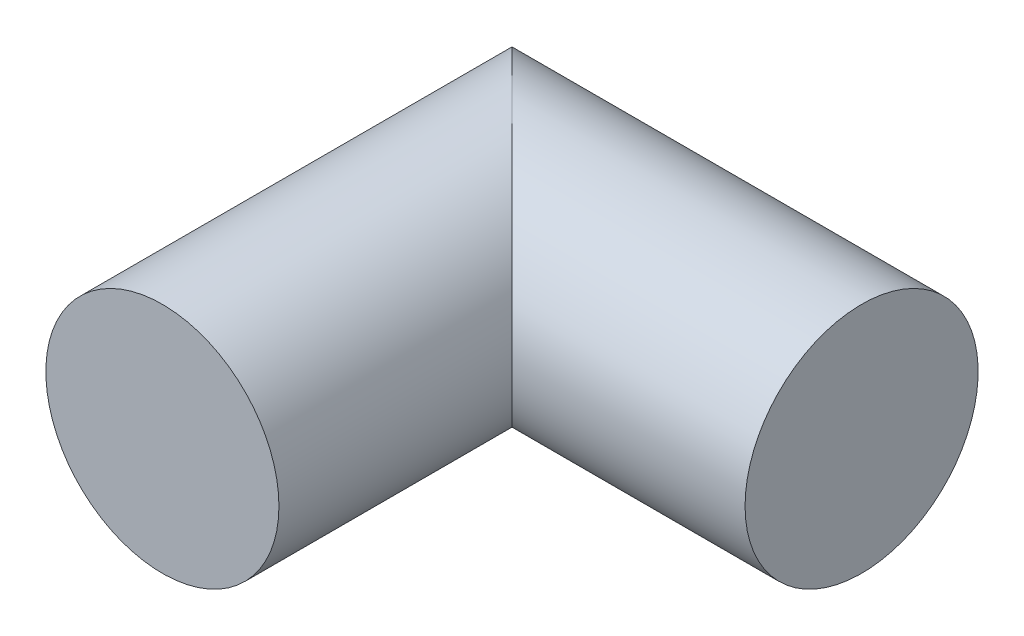
ISO-10303-21;
HEADER;
FILE_DESCRIPTION(('STEP AP214'),'2;1');
FILE_NAME('part.step','',(''),(''),'','','');
FILE_SCHEMA(('AUTOMOTIVE_DESIGN { 1 0 10303 214 1 1 1 1 }'));
ENDSEC;
DATA;
#1=APPLICATION_CONTEXT('core data for automotive mechanical design processes');
#2=APPLICATION_PROTOCOL_DEFINITION('international standard','automotive_design',2000,#1);
#3=PRODUCT_CONTEXT('',#1,'mechanical');
#4=PRODUCT('Part','Part','',(#3));
#5=PRODUCT_RELATED_PRODUCT_CATEGORY('part','',(#4));
#6=PRODUCT_DEFINITION_FORMATION('','',#4);
#7=PRODUCT_DEFINITION_CONTEXT('part definition',#1,'design');
#8=PRODUCT_DEFINITION('design','',#6,#7);
#9=PRODUCT_DEFINITION_SHAPE('','',#8);
#10=(LENGTH_UNIT() NAMED_UNIT(*) SI_UNIT(.MILLI.,.METRE.));
#11=(NAMED_UNIT(*) PLANE_ANGLE_UNIT() SI_UNIT($,.RADIAN.));
#12=(NAMED_UNIT(*) SI_UNIT($,.STERADIAN.) SOLID_ANGLE_UNIT());
#13=UNCERTAINTY_MEASURE_WITH_UNIT(LENGTH_MEASURE(1.E-05),#10,'distance_accuracy_value','');
#14=(GEOMETRIC_REPRESENTATION_CONTEXT(3) GLOBAL_UNCERTAINTY_ASSIGNED_CONTEXT((#13)) GLOBAL_UNIT_ASSIGNED_CONTEXT((#10,
#11,#12)) REPRESENTATION_CONTEXT('',''));
#15=CARTESIAN_POINT('',(0.,0.,0.));
#16=DIRECTION('',(0.,0.,1.));
#17=DIRECTION('',(1.,0.,0.));
#18=AXIS2_PLACEMENT_3D('',#15,#16,#17);
#19=CARTESIAN_POINT('',(-15.,0.,15.));
#20=DIRECTION('',(0.,0.,1.));
#21=DIRECTION('',(1.,0.,0.));
#22=AXIS2_PLACEMENT_3D('',#19,#20,#21);
#23=PLANE('',#22);
#24=CARTESIAN_POINT('',(-15.,0.,15.));
#25=DIRECTION('',(0.,0.,1.));
#26=DIRECTION('',(1.,0.,0.));
#27=AXIS2_PLACEMENT_3D('',#24,#25,#26);
#28=CIRCLE('',#27,5.);
#29=CARTESIAN_POINT('',(-10.,0.,15.));
#30=VERTEX_POINT('',#29);
#31=EDGE_CURVE('E33',#30,#30,#28,.T.);
#32=ORIENTED_EDGE('',*,*,#31,.T.);
#33=EDGE_LOOP('',(#32));
#34=FACE_BOUND('',#33,.T.);
#35=ADVANCED_FACE('F30',(#34),#23,.T.);
#36=CARTESIAN_POINT('',(0.,0.,0.));
#37=DIRECTION('',(-1.,0.,0.));
#38=DIRECTION('',(0.,0.,1.));
#39=AXIS2_PLACEMENT_3D('',#36,#37,#38);
#40=PLANE('',#39);
#41=CARTESIAN_POINT('',(0.,0.,0.));
#42=DIRECTION('',(-1.,0.,0.));
#43=DIRECTION('',(0.,0.,1.));
#44=AXIS2_PLACEMENT_3D('',#41,#42,#43);
#45=CIRCLE('',#44,5.);
#46=CARTESIAN_POINT('',(0.,0.,5.));
#47=VERTEX_POINT('',#46);
#48=EDGE_CURVE('E37',#47,#47,#45,.T.);
#49=ORIENTED_EDGE('',*,*,#48,.F.);
#50=EDGE_LOOP('',(#49));
#51=FACE_BOUND('',#50,.T.);
#52=ADVANCED_FACE('F51',(#51),#40,.F.);
#53=CARTESIAN_POINT('',(-15.,0.,-5.6));
#54=DIRECTION('',(0.,0.,1.));
#55=DIRECTION('',(1.,0.,0.));
#56=AXIS2_PLACEMENT_3D('',#53,#54,#55);
#57=CYLINDRICAL_SURFACE('',#56,5.);
#58=CARTESIAN_POINT('',(-15.,0.,0.));
#59=DIRECTION('',(-0.707106781186547,0.,0.707106781186547));
#60=DIRECTION('',(-0.707106781186548,0.,-0.707106781186548));
#61=AXIS2_PLACEMENT_3D('',#58,#59,#60);
#62=ELLIPSE('',#61,7.07106781186548,5.);
#63=CARTESIAN_POINT('',(-20.,0.,-5.));
#64=VERTEX_POINT('',#63);
#65=EDGE_CURVE('E10',#64,#64,#62,.F.);
#66=ORIENTED_EDGE('',*,*,#65,.F.);
#67=EDGE_LOOP('',(#66));
#68=FACE_BOUND('',#67,.T.);
#69=ORIENTED_EDGE('',*,*,#31,.F.);
#70=EDGE_LOOP('',(#69));
#71=FACE_BOUND('',#70,.T.);
#72=ADVANCED_FACE('F48',(#68,#71),#57,.T.);
#73=CARTESIAN_POINT('',(0.,0.,0.));
#74=DIRECTION('',(-1.,0.,0.));
#75=DIRECTION('',(0.,0.,1.));
#76=AXIS2_PLACEMENT_3D('',#73,#74,#75);
#77=CYLINDRICAL_SURFACE('',#76,5.);
#78=ORIENTED_EDGE('',*,*,#48,.T.);
#79=EDGE_LOOP('',(#78));
#80=FACE_BOUND('',#79,.T.);
#81=ORIENTED_EDGE('',*,*,#65,.T.);
#82=EDGE_LOOP('',(#81));
#83=FACE_BOUND('',#82,.T.);
#84=ADVANCED_FACE('F50',(#80,#83),#77,.T.);
#85=CLOSED_SHELL('',(#35,#52,#72,#84));
#86=MANIFOLD_SOLID_BREP('B2',#85);
#87=ADVANCED_BREP_SHAPE_REPRESENTATION('',(#18,#86),#14);
#88=SHAPE_DEFINITION_REPRESENTATION(#9,#87);
ENDSEC;
END-ISO-10303-21;
